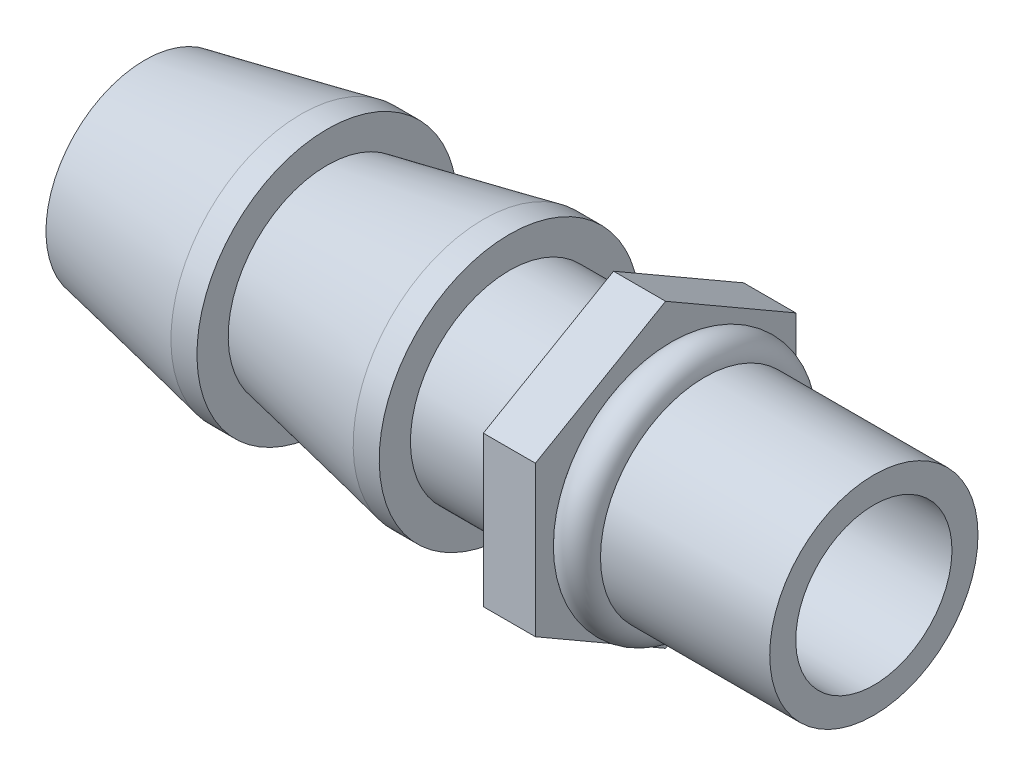
ISO-10303-21;
HEADER;
FILE_DESCRIPTION(('STEP AP214'),'2;1');
FILE_NAME('part.step','',(''),(''),'','','');
FILE_SCHEMA(('AUTOMOTIVE_DESIGN { 1 0 10303 214 1 1 1 1 }'));
ENDSEC;
DATA;
#1=APPLICATION_CONTEXT('core data for automotive mechanical design processes');
#2=APPLICATION_PROTOCOL_DEFINITION('international standard','automotive_design',2000,#1);
#3=PRODUCT_CONTEXT('',#1,'mechanical');
#4=PRODUCT('Part','Part','',(#3));
#5=PRODUCT_RELATED_PRODUCT_CATEGORY('part','',(#4));
#6=PRODUCT_DEFINITION_FORMATION('','',#4);
#7=PRODUCT_DEFINITION_CONTEXT('part definition',#1,'design');
#8=PRODUCT_DEFINITION('design','',#6,#7);
#9=PRODUCT_DEFINITION_SHAPE('','',#8);
#10=(LENGTH_UNIT() NAMED_UNIT(*) SI_UNIT(.MILLI.,.METRE.));
#11=(NAMED_UNIT(*) PLANE_ANGLE_UNIT() SI_UNIT($,.RADIAN.));
#12=(NAMED_UNIT(*) SI_UNIT($,.STERADIAN.) SOLID_ANGLE_UNIT());
#13=UNCERTAINTY_MEASURE_WITH_UNIT(LENGTH_MEASURE(1.E-05),#10,'distance_accuracy_value','');
#14=(GEOMETRIC_REPRESENTATION_CONTEXT(3) GLOBAL_UNCERTAINTY_ASSIGNED_CONTEXT((#13)) GLOBAL_UNIT_ASSIGNED_CONTEXT((#10,
#11,#12)) REPRESENTATION_CONTEXT('',''));
#15=CARTESIAN_POINT('',(0.,0.,0.));
#16=DIRECTION('',(0.,0.,1.));
#17=DIRECTION('',(1.,0.,0.));
#18=AXIS2_PLACEMENT_3D('',#15,#16,#17);
#19=CARTESIAN_POINT('',(-10.75,1.5,0.));
#20=DIRECTION('',(-1.,0.,0.));
#21=DIRECTION('',(0.,-1.,0.));
#22=AXIS2_PLACEMENT_3D('',#19,#20,#21);
#23=PLANE('',#22);
#24=CARTESIAN_POINT('',(-10.75,0.,0.));
#25=DIRECTION('',(1.,0.,0.));
#26=DIRECTION('',(0.,1.,0.));
#27=AXIS2_PLACEMENT_3D('',#24,#25,#26);
#28=CIRCLE('',#27,1.5);
#29=CARTESIAN_POINT('',(-10.75,1.5,0.));
#30=VERTEX_POINT('',#29);
#31=EDGE_CURVE('E148',#30,#30,#28,.T.);
#32=ORIENTED_EDGE('',*,*,#31,.T.);
#33=EDGE_LOOP('',(#32));
#34=FACE_BOUND('',#33,.T.);
#35=CARTESIAN_POINT('',(-10.75,0.,0.));
#36=DIRECTION('',(1.,0.,0.));
#37=DIRECTION('',(0.,1.,0.));
#38=AXIS2_PLACEMENT_3D('',#35,#36,#37);
#39=CIRCLE('',#38,1.9);
#40=CARTESIAN_POINT('',(-10.75,1.9,0.));
#41=VERTEX_POINT('',#40);
#42=EDGE_CURVE('E50',#41,#41,#39,.T.);
#43=ORIENTED_EDGE('',*,*,#42,.F.);
#44=EDGE_LOOP('',(#43));
#45=FACE_BOUND('',#44,.T.);
#46=ADVANCED_FACE('F41',(#34,#45),#23,.T.);
#47=CARTESIAN_POINT('',(-7.75,0.,0.));
#48=DIRECTION('',(1.,0.,0.));
#49=DIRECTION('',(0.,1.,0.));
#50=AXIS2_PLACEMENT_3D('',#47,#48,#49);
#51=CONICAL_SURFACE('',#50,2.5,0.197395559849881);
#52=ORIENTED_EDGE('',*,*,#42,.T.);
#53=EDGE_LOOP('',(#52));
#54=FACE_BOUND('',#53,.T.);
#55=CARTESIAN_POINT('',(-7.75,0.,0.));
#56=DIRECTION('',(1.,0.,0.));
#57=DIRECTION('',(0.,1.,0.));
#58=AXIS2_PLACEMENT_3D('',#55,#56,#57);
#59=CIRCLE('',#58,2.5);
#60=CARTESIAN_POINT('',(-7.75,2.5,0.));
#61=VERTEX_POINT('',#60);
#62=EDGE_CURVE('E169',#61,#61,#59,.T.);
#63=ORIENTED_EDGE('',*,*,#62,.F.);
#64=EDGE_LOOP('',(#63));
#65=FACE_BOUND('',#64,.T.);
#66=ADVANCED_FACE('F174',(#54,#65),#51,.T.);
#67=CARTESIAN_POINT('',(0.,0.,0.));
#68=DIRECTION('',(1.,0.,0.));
#69=DIRECTION('',(0.,1.,0.));
#70=AXIS2_PLACEMENT_3D('',#67,#68,#69);
#71=CYLINDRICAL_SURFACE('',#70,2.5);
#72=ORIENTED_EDGE('',*,*,#62,.T.);
#73=EDGE_LOOP('',(#72));
#74=FACE_BOUND('',#73,.T.);
#75=CARTESIAN_POINT('',(-7.25,0.,0.));
#76=DIRECTION('',(1.,0.,0.));
#77=DIRECTION('',(0.,1.,0.));
#78=AXIS2_PLACEMENT_3D('',#75,#76,#77);
#79=CIRCLE('',#78,2.5);
#80=CARTESIAN_POINT('',(-7.25,2.5,0.));
#81=VERTEX_POINT('',#80);
#82=EDGE_CURVE('E166',#81,#81,#79,.T.);
#83=ORIENTED_EDGE('',*,*,#82,.F.);
#84=EDGE_LOOP('',(#83));
#85=FACE_BOUND('',#84,.T.);
#86=ADVANCED_FACE('F182',(#74,#85),#71,.T.);
#87=CARTESIAN_POINT('',(-7.25,2.5,0.));
#88=DIRECTION('',(1.,0.,0.));
#89=DIRECTION('',(0.,1.,0.));
#90=AXIS2_PLACEMENT_3D('',#87,#88,#89);
#91=PLANE('',#90);
#92=ORIENTED_EDGE('',*,*,#82,.T.);
#93=EDGE_LOOP('',(#92));
#94=FACE_BOUND('',#93,.T.);
#95=CARTESIAN_POINT('',(-7.25,0.,0.));
#96=DIRECTION('',(1.,0.,0.));
#97=DIRECTION('',(0.,1.,0.));
#98=AXIS2_PLACEMENT_3D('',#95,#96,#97);
#99=CIRCLE('',#98,1.9);
#100=CARTESIAN_POINT('',(-7.25,1.9,0.));
#101=VERTEX_POINT('',#100);
#102=EDGE_CURVE('E163',#101,#101,#99,.T.);
#103=ORIENTED_EDGE('',*,*,#102,.F.);
#104=EDGE_LOOP('',(#103));
#105=FACE_BOUND('',#104,.T.);
#106=ADVANCED_FACE('F248',(#94,#105),#91,.T.);
#107=CARTESIAN_POINT('',(-4.25,0.,0.));
#108=DIRECTION('',(1.,0.,0.));
#109=DIRECTION('',(0.,1.,0.));
#110=AXIS2_PLACEMENT_3D('',#107,#108,#109);
#111=CONICAL_SURFACE('',#110,2.5,0.197395559849881);
#112=ORIENTED_EDGE('',*,*,#102,.T.);
#113=EDGE_LOOP('',(#112));
#114=FACE_BOUND('',#113,.T.);
#115=CARTESIAN_POINT('',(-4.25,0.,0.));
#116=DIRECTION('',(1.,0.,0.));
#117=DIRECTION('',(0.,1.,0.));
#118=AXIS2_PLACEMENT_3D('',#115,#116,#117);
#119=CIRCLE('',#118,2.5);
#120=CARTESIAN_POINT('',(-4.25,2.5,0.));
#121=VERTEX_POINT('',#120);
#122=EDGE_CURVE('E160',#121,#121,#119,.T.);
#123=ORIENTED_EDGE('',*,*,#122,.F.);
#124=EDGE_LOOP('',(#123));
#125=FACE_BOUND('',#124,.T.);
#126=ADVANCED_FACE('F244',(#114,#125),#111,.T.);
#127=CARTESIAN_POINT('',(0.,0.,0.));
#128=DIRECTION('',(1.,0.,0.));
#129=DIRECTION('',(0.,1.,0.));
#130=AXIS2_PLACEMENT_3D('',#127,#128,#129);
#131=CYLINDRICAL_SURFACE('',#130,2.5);
#132=ORIENTED_EDGE('',*,*,#122,.T.);
#133=EDGE_LOOP('',(#132));
#134=FACE_BOUND('',#133,.T.);
#135=CARTESIAN_POINT('',(-3.75,0.,0.));
#136=DIRECTION('',(1.,0.,0.));
#137=DIRECTION('',(0.,1.,0.));
#138=AXIS2_PLACEMENT_3D('',#135,#136,#137);
#139=CIRCLE('',#138,2.5);
#140=CARTESIAN_POINT('',(-3.75,2.5,0.));
#141=VERTEX_POINT('',#140);
#142=EDGE_CURVE('E157',#141,#141,#139,.T.);
#143=ORIENTED_EDGE('',*,*,#142,.F.);
#144=EDGE_LOOP('',(#143));
#145=FACE_BOUND('',#144,.T.);
#146=ADVANCED_FACE('F240',(#134,#145),#131,.T.);
#147=CARTESIAN_POINT('',(-3.75,2.5,0.));
#148=DIRECTION('',(1.,0.,0.));
#149=DIRECTION('',(0.,1.,0.));
#150=AXIS2_PLACEMENT_3D('',#147,#148,#149);
#151=PLANE('',#150);
#152=ORIENTED_EDGE('',*,*,#142,.T.);
#153=EDGE_LOOP('',(#152));
#154=FACE_BOUND('',#153,.T.);
#155=CARTESIAN_POINT('',(-3.75,0.,0.));
#156=DIRECTION('',(1.,0.,0.));
#157=DIRECTION('',(0.,1.,0.));
#158=AXIS2_PLACEMENT_3D('',#155,#156,#157);
#159=CIRCLE('',#158,1.9);
#160=CARTESIAN_POINT('',(-3.75,1.9,0.));
#161=VERTEX_POINT('',#160);
#162=EDGE_CURVE('E154',#161,#161,#159,.T.);
#163=ORIENTED_EDGE('',*,*,#162,.F.);
#164=EDGE_LOOP('',(#163));
#165=FACE_BOUND('',#164,.T.);
#166=ADVANCED_FACE('F236',(#154,#165),#151,.T.);
#167=CARTESIAN_POINT('',(0.,0.,0.));
#168=DIRECTION('',(1.,0.,0.));
#169=DIRECTION('',(0.,1.,0.));
#170=AXIS2_PLACEMENT_3D('',#167,#168,#169);
#171=CYLINDRICAL_SURFACE('',#170,1.9);
#172=ORIENTED_EDGE('',*,*,#162,.T.);
#173=EDGE_LOOP('',(#172));
#174=FACE_BOUND('',#173,.T.);
#175=CARTESIAN_POINT('',(-1.75,0.,0.));
#176=DIRECTION('',(1.,0.,0.));
#177=DIRECTION('',(0.,1.,0.));
#178=AXIS2_PLACEMENT_3D('',#175,#176,#177);
#179=CIRCLE('',#178,1.9);
#180=CARTESIAN_POINT('',(-1.75,1.9,0.));
#181=VERTEX_POINT('',#180);
#182=EDGE_CURVE('E151',#181,#181,#179,.T.);
#183=ORIENTED_EDGE('',*,*,#182,.F.);
#184=EDGE_LOOP('',(#183));
#185=FACE_BOUND('',#184,.T.);
#186=ADVANCED_FACE('F188',(#174,#185),#171,.T.);
#187=CARTESIAN_POINT('',(0.,0.,0.));
#188=DIRECTION('',(1.,0.,0.));
#189=DIRECTION('',(0.,1.,0.));
#190=AXIS2_PLACEMENT_3D('',#187,#188,#189);
#191=CYLINDRICAL_SURFACE('',#190,1.5);
#192=ORIENTED_EDGE('',*,*,#31,.F.);
#193=EDGE_LOOP('',(#192));
#194=FACE_BOUND('',#193,.T.);
#195=CARTESIAN_POINT('',(3.25,0.,0.));
#196=DIRECTION('',(1.,0.,0.));
#197=DIRECTION('',(0.,1.,0.));
#198=AXIS2_PLACEMENT_3D('',#195,#196,#197);
#199=CIRCLE('',#198,1.5);
#200=CARTESIAN_POINT('',(3.25,1.5,0.));
#201=VERTEX_POINT('',#200);
#202=EDGE_CURVE('E192',#201,#201,#199,.T.);
#203=ORIENTED_EDGE('',*,*,#202,.T.);
#204=EDGE_LOOP('',(#203));
#205=FACE_BOUND('',#204,.T.);
#206=ADVANCED_FACE('F185',(#194,#205),#191,.F.);
#207=CARTESIAN_POINT('',(-0.75,0.,0.));
#208=DIRECTION('',(-1.,0.,0.));
#209=DIRECTION('',(0.,-1.,0.));
#210=AXIS2_PLACEMENT_3D('',#207,#208,#209);
#211=PLANE('',#210);
#212=CARTESIAN_POINT('',(-0.75,0.,0.));
#213=DIRECTION('',(1.,0.,0.));
#214=DIRECTION('',(0.,1.,0.));
#215=AXIS2_PLACEMENT_3D('',#212,#213,#214);
#216=CIRCLE('',#215,2.);
#217=CARTESIAN_POINT('',(-0.75,2.,0.));
#218=VERTEX_POINT('',#217);
#219=EDGE_CURVE('E11',#218,#218,#216,.T.);
#220=ORIENTED_EDGE('',*,*,#219,.F.);
#221=EDGE_LOOP('',(#220));
#222=FACE_BOUND('',#221,.T.);
#223=DIRECTION('',(0.,-0.5,-0.866025403784439));
#224=VECTOR('',#223,1.);
#225=CARTESIAN_POINT('',(-0.749999999999999,-2.88675134594813,0.));
#226=LINE('',#225,#224);
#227=CARTESIAN_POINT('',(-0.749999999999999,-1.44337567297407,2.5));
#228=VERTEX_POINT('',#227);
#229=CARTESIAN_POINT('',(-0.749999999999999,-2.88675134594813,0.));
#230=VERTEX_POINT('',#229);
#231=EDGE_CURVE('E139',#228,#230,#226,.T.);
#232=ORIENTED_EDGE('',*,*,#231,.T.);
#233=DIRECTION('',(0.,0.5,-0.866025403784439));
#234=VECTOR('',#233,1.);
#235=CARTESIAN_POINT('',(-0.749999999999999,-1.44337567297407,-2.5));
#236=LINE('',#235,#234);
#237=CARTESIAN_POINT('',(-0.749999999999999,-1.44337567297407,-2.5));
#238=VERTEX_POINT('',#237);
#239=EDGE_CURVE('E97',#230,#238,#236,.T.);
#240=ORIENTED_EDGE('',*,*,#239,.T.);
#241=DIRECTION('',(0.,1.,0.));
#242=VECTOR('',#241,1.);
#243=CARTESIAN_POINT('',(-0.75,1.44337567297406,-2.5));
#244=LINE('',#243,#242);
#245=CARTESIAN_POINT('',(-0.75,1.44337567297406,-2.5));
#246=VERTEX_POINT('',#245);
#247=EDGE_CURVE('E110',#238,#246,#244,.T.);
#248=ORIENTED_EDGE('',*,*,#247,.T.);
#249=DIRECTION('',(0.,0.5,0.866025403784438));
#250=VECTOR('',#249,1.);
#251=CARTESIAN_POINT('',(-0.75,2.88675134594813,0.));
#252=LINE('',#251,#250);
#253=CARTESIAN_POINT('',(-0.75,2.88675134594813,0.));
#254=VERTEX_POINT('',#253);
#255=EDGE_CURVE('E104',#246,#254,#252,.T.);
#256=ORIENTED_EDGE('',*,*,#255,.T.);
#257=DIRECTION('',(0.,-0.5,0.866025403784438));
#258=VECTOR('',#257,1.);
#259=CARTESIAN_POINT('',(-0.75,1.44337567297406,2.5));
#260=LINE('',#259,#258);
#261=CARTESIAN_POINT('',(-0.75,1.44337567297406,2.5));
#262=VERTEX_POINT('',#261);
#263=EDGE_CURVE('E108',#254,#262,#260,.T.);
#264=ORIENTED_EDGE('',*,*,#263,.T.);
#265=DIRECTION('',(0.,-1.,0.));
#266=VECTOR('',#265,1.);
#267=CARTESIAN_POINT('',(-0.749999999999999,-1.44337567297407,2.5));
#268=LINE('',#267,#266);
#269=EDGE_CURVE('E59',#262,#228,#268,.T.);
#270=ORIENTED_EDGE('',*,*,#269,.T.);
#271=EDGE_LOOP('',(#232,#240,#248,#256,#264,#270));
#272=FACE_BOUND('',#271,.T.);
#273=ADVANCED_FACE('F106',(#222,#272),#211,.F.);
#274=CARTESIAN_POINT('',(-1.75,0.,0.));
#275=DIRECTION('',(-1.,0.,0.));
#276=DIRECTION('',(0.,-1.,0.));
#277=AXIS2_PLACEMENT_3D('',#274,#275,#276);
#278=PLANE('',#277);
#279=ORIENTED_EDGE('',*,*,#182,.T.);
#280=EDGE_LOOP('',(#279));
#281=FACE_BOUND('',#280,.T.);
#282=DIRECTION('',(0.,-0.5,-0.866025403784439));
#283=VECTOR('',#282,1.);
#284=CARTESIAN_POINT('',(-1.75,-2.88675134594813,0.));
#285=LINE('',#284,#283);
#286=CARTESIAN_POINT('',(-1.75,-1.44337567297407,2.5));
#287=VERTEX_POINT('',#286);
#288=CARTESIAN_POINT('',(-1.75,-2.88675134594813,0.));
#289=VERTEX_POINT('',#288);
#290=EDGE_CURVE('E128',#287,#289,#285,.T.);
#291=ORIENTED_EDGE('',*,*,#290,.F.);
#292=DIRECTION('',(0.,-1.,0.));
#293=VECTOR('',#292,1.);
#294=CARTESIAN_POINT('',(-1.75,-1.44337567297407,2.5));
#295=LINE('',#294,#293);
#296=CARTESIAN_POINT('',(-1.75,1.44337567297406,2.5));
#297=VERTEX_POINT('',#296);
#298=EDGE_CURVE('E88',#297,#287,#295,.T.);
#299=ORIENTED_EDGE('',*,*,#298,.F.);
#300=DIRECTION('',(0.,-0.5,0.866025403784438));
#301=VECTOR('',#300,1.);
#302=CARTESIAN_POINT('',(-1.75,1.44337567297406,2.5));
#303=LINE('',#302,#301);
#304=CARTESIAN_POINT('',(-1.75,2.88675134594813,0.));
#305=VERTEX_POINT('',#304);
#306=EDGE_CURVE('E82',#305,#297,#303,.T.);
#307=ORIENTED_EDGE('',*,*,#306,.F.);
#308=DIRECTION('',(0.,0.5,0.866025403784438));
#309=VECTOR('',#308,1.);
#310=CARTESIAN_POINT('',(-1.75,2.88675134594813,0.));
#311=LINE('',#310,#309);
#312=CARTESIAN_POINT('',(-1.75,1.44337567297406,-2.5));
#313=VERTEX_POINT('',#312);
#314=EDGE_CURVE('E118',#313,#305,#311,.T.);
#315=ORIENTED_EDGE('',*,*,#314,.F.);
#316=DIRECTION('',(0.,1.,0.));
#317=VECTOR('',#316,1.);
#318=CARTESIAN_POINT('',(-1.75,1.44337567297406,-2.5));
#319=LINE('',#318,#317);
#320=CARTESIAN_POINT('',(-1.75,-1.44337567297407,-2.5));
#321=VERTEX_POINT('',#320);
#322=EDGE_CURVE('E134',#321,#313,#319,.T.);
#323=ORIENTED_EDGE('',*,*,#322,.F.);
#324=DIRECTION('',(0.,0.5,-0.866025403784439));
#325=VECTOR('',#324,1.);
#326=CARTESIAN_POINT('',(-1.75,-1.44337567297407,-2.5));
#327=LINE('',#326,#325);
#328=EDGE_CURVE('E131',#289,#321,#327,.T.);
#329=ORIENTED_EDGE('',*,*,#328,.F.);
#330=EDGE_LOOP('',(#291,#299,#307,#315,#323,#329));
#331=FACE_BOUND('',#330,.T.);
#332=ADVANCED_FACE('F208',(#281,#331),#278,.T.);
#333=CARTESIAN_POINT('',(-0.749999999999999,-2.88675134594813,0.));
#334=DIRECTION('',(0.,0.866025403784439,-0.5));
#335=DIRECTION('',(0.,0.5,0.866025403784439));
#336=AXIS2_PLACEMENT_3D('',#333,#334,#335);
#337=PLANE('',#336);
#338=ORIENTED_EDGE('',*,*,#290,.T.);
#339=DIRECTION('',(-1.,0.,0.));
#340=VECTOR('',#339,1.);
#341=CARTESIAN_POINT('',(-0.749999999999999,-2.88675134594813,0.));
#342=LINE('',#341,#340);
#343=EDGE_CURVE('E146',#230,#289,#342,.T.);
#344=ORIENTED_EDGE('',*,*,#343,.F.);
#345=ORIENTED_EDGE('',*,*,#231,.F.);
#346=DIRECTION('',(-1.,0.,0.));
#347=VECTOR('',#346,1.);
#348=CARTESIAN_POINT('',(-0.749999999999999,-1.44337567297407,2.5));
#349=LINE('',#348,#347);
#350=EDGE_CURVE('E124',#228,#287,#349,.T.);
#351=ORIENTED_EDGE('',*,*,#350,.T.);
#352=EDGE_LOOP('',(#338,#344,#345,#351));
#353=FACE_BOUND('',#352,.T.);
#354=ADVANCED_FACE('F210',(#353),#337,.F.);
#355=CARTESIAN_POINT('',(-0.749999999999999,-1.44337567297407,-2.5));
#356=DIRECTION('',(0.,0.866025403784439,0.5));
#357=DIRECTION('',(0.,-0.5,0.866025403784439));
#358=AXIS2_PLACEMENT_3D('',#355,#356,#357);
#359=PLANE('',#358);
#360=ORIENTED_EDGE('',*,*,#328,.T.);
#361=DIRECTION('',(-1.,0.,0.));
#362=VECTOR('',#361,1.);
#363=CARTESIAN_POINT('',(-0.749999999999999,-1.44337567297407,-2.5));
#364=LINE('',#363,#362);
#365=EDGE_CURVE('E143',#238,#321,#364,.T.);
#366=ORIENTED_EDGE('',*,*,#365,.F.);
#367=ORIENTED_EDGE('',*,*,#239,.F.);
#368=ORIENTED_EDGE('',*,*,#343,.T.);
#369=EDGE_LOOP('',(#360,#366,#367,#368));
#370=FACE_BOUND('',#369,.T.);
#371=ADVANCED_FACE('F202',(#370),#359,.F.);
#372=CARTESIAN_POINT('',(-0.75,1.44337567297406,-2.5));
#373=DIRECTION('',(0.,0.,1.));
#374=DIRECTION('',(1.,0.,0.));
#375=AXIS2_PLACEMENT_3D('',#372,#373,#374);
#376=PLANE('',#375);
#377=ORIENTED_EDGE('',*,*,#322,.T.);
#378=DIRECTION('',(-1.,0.,0.));
#379=VECTOR('',#378,1.);
#380=CARTESIAN_POINT('',(-0.75,1.44337567297406,-2.5));
#381=LINE('',#380,#379);
#382=EDGE_CURVE('E119',#246,#313,#381,.T.);
#383=ORIENTED_EDGE('',*,*,#382,.F.);
#384=ORIENTED_EDGE('',*,*,#247,.F.);
#385=ORIENTED_EDGE('',*,*,#365,.T.);
#386=EDGE_LOOP('',(#377,#383,#384,#385));
#387=FACE_BOUND('',#386,.T.);
#388=ADVANCED_FACE('F205',(#387),#376,.F.);
#389=CARTESIAN_POINT('',(-0.75,2.88675134594813,0.));
#390=DIRECTION('',(0.,-0.866025403784438,0.5));
#391=DIRECTION('',(0.,-0.5,-0.866025403784438));
#392=AXIS2_PLACEMENT_3D('',#389,#390,#391);
#393=PLANE('',#392);
#394=ORIENTED_EDGE('',*,*,#314,.T.);
#395=DIRECTION('',(-1.,0.,0.));
#396=VECTOR('',#395,1.);
#397=CARTESIAN_POINT('',(-0.75,2.88675134594813,0.));
#398=LINE('',#397,#396);
#399=EDGE_CURVE('E115',#254,#305,#398,.T.);
#400=ORIENTED_EDGE('',*,*,#399,.F.);
#401=ORIENTED_EDGE('',*,*,#255,.F.);
#402=ORIENTED_EDGE('',*,*,#382,.T.);
#403=EDGE_LOOP('',(#394,#400,#401,#402));
#404=FACE_BOUND('',#403,.T.);
#405=ADVANCED_FACE('F116',(#404),#393,.F.);
#406=CARTESIAN_POINT('',(-0.75,1.44337567297406,2.5));
#407=DIRECTION('',(0.,-0.866025403784438,-0.5));
#408=DIRECTION('',(0.,0.5,-0.866025403784439));
#409=AXIS2_PLACEMENT_3D('',#406,#407,#408);
#410=PLANE('',#409);
#411=ORIENTED_EDGE('',*,*,#306,.T.);
#412=DIRECTION('',(-1.,0.,0.));
#413=VECTOR('',#412,1.);
#414=CARTESIAN_POINT('',(-0.75,1.44337567297406,2.5));
#415=LINE('',#414,#413);
#416=EDGE_CURVE('E120',#262,#297,#415,.T.);
#417=ORIENTED_EDGE('',*,*,#416,.F.);
#418=ORIENTED_EDGE('',*,*,#263,.F.);
#419=ORIENTED_EDGE('',*,*,#399,.T.);
#420=EDGE_LOOP('',(#411,#417,#418,#419));
#421=FACE_BOUND('',#420,.T.);
#422=ADVANCED_FACE('F122',(#421),#410,.F.);
#423=CARTESIAN_POINT('',(-0.749999999999999,-1.44337567297407,2.5));
#424=DIRECTION('',(0.,0.,-1.));
#425=DIRECTION('',(0.,1.,0.));
#426=AXIS2_PLACEMENT_3D('',#423,#424,#425);
#427=PLANE('',#426);
#428=ORIENTED_EDGE('',*,*,#298,.T.);
#429=ORIENTED_EDGE('',*,*,#350,.F.);
#430=ORIENTED_EDGE('',*,*,#269,.F.);
#431=ORIENTED_EDGE('',*,*,#416,.T.);
#432=EDGE_LOOP('',(#428,#429,#430,#431));
#433=FACE_BOUND('',#432,.T.);
#434=ADVANCED_FACE('F211',(#433),#427,.F.);
#435=CARTESIAN_POINT('',(3.25,0.,0.));
#436=DIRECTION('',(1.,0.,0.));
#437=DIRECTION('',(0.,1.,0.));
#438=AXIS2_PLACEMENT_3D('',#435,#436,#437);
#439=PLANE('',#438);
#440=CARTESIAN_POINT('',(3.25,0.,0.));
#441=DIRECTION('',(1.,0.,0.));
#442=DIRECTION('',(0.,1.,0.));
#443=AXIS2_PLACEMENT_3D('',#440,#441,#442);
#444=CIRCLE('',#443,2.);
#445=CARTESIAN_POINT('',(3.25,2.,0.));
#446=VERTEX_POINT('',#445);
#447=EDGE_CURVE('E132',#446,#446,#444,.T.);
#448=ORIENTED_EDGE('',*,*,#447,.T.);
#449=EDGE_LOOP('',(#448));
#450=FACE_BOUND('',#449,.T.);
#451=ORIENTED_EDGE('',*,*,#202,.F.);
#452=EDGE_LOOP('',(#451));
#453=FACE_BOUND('',#452,.T.);
#454=ADVANCED_FACE('F213',(#450,#453),#439,.T.);
#455=CARTESIAN_POINT('',(3.25,0.,0.));
#456=DIRECTION('',(-1.,0.,0.));
#457=DIRECTION('',(0.,-1.,0.));
#458=AXIS2_PLACEMENT_3D('',#455,#456,#457);
#459=CYLINDRICAL_SURFACE('',#458,2.);
#460=CARTESIAN_POINT('',(0.,0.,0.));
#461=DIRECTION('',(-1.,0.,0.));
#462=DIRECTION('',(0.,-1.,0.));
#463=AXIS2_PLACEMENT_3D('',#460,#461,#462);
#464=CIRCLE('',#463,2.);
#465=CARTESIAN_POINT('',(0.,-2.,0.));
#466=VERTEX_POINT('',#465);
#467=EDGE_CURVE('E44',#466,#466,#464,.F.);
#468=ORIENTED_EDGE('',*,*,#467,.T.);
#469=EDGE_LOOP('',(#468));
#470=FACE_BOUND('',#469,.T.);
#471=ORIENTED_EDGE('',*,*,#447,.F.);
#472=EDGE_LOOP('',(#471));
#473=FACE_BOUND('',#472,.T.);
#474=ADVANCED_FACE('F219',(#470,#473),#459,.T.);
#475=CARTESIAN_POINT('',(-0.374999999999999,0.,0.));
#476=DIRECTION('',(1.,0.,0.));
#477=DIRECTION('',(0.,1.,0.));
#478=AXIS2_PLACEMENT_3D('',#475,#476,#477);
#479=TOROIDAL_SURFACE('',#478,2.,0.375);
#480=ORIENTED_EDGE('',*,*,#467,.F.);
#481=EDGE_LOOP('',(#480));
#482=FACE_BOUND('',#481,.T.);
#483=ORIENTED_EDGE('',*,*,#219,.T.);
#484=EDGE_LOOP('',(#483));
#485=FACE_BOUND('',#484,.T.);
#486=ADVANCED_FACE('F281',(#482,#485),#479,.T.);
#487=CLOSED_SHELL('',(#46,#66,#86,#106,#126,#146,#166,#186,#206,#273,#332,#354,#371,#388,#405,
#422,#434,#454,#474,#486));
#488=MANIFOLD_SOLID_BREP('B2',#487);
#489=ADVANCED_BREP_SHAPE_REPRESENTATION('',(#18,#488),#14);
#490=SHAPE_DEFINITION_REPRESENTATION(#9,#489);
ENDSEC;
END-ISO-10303-21;
